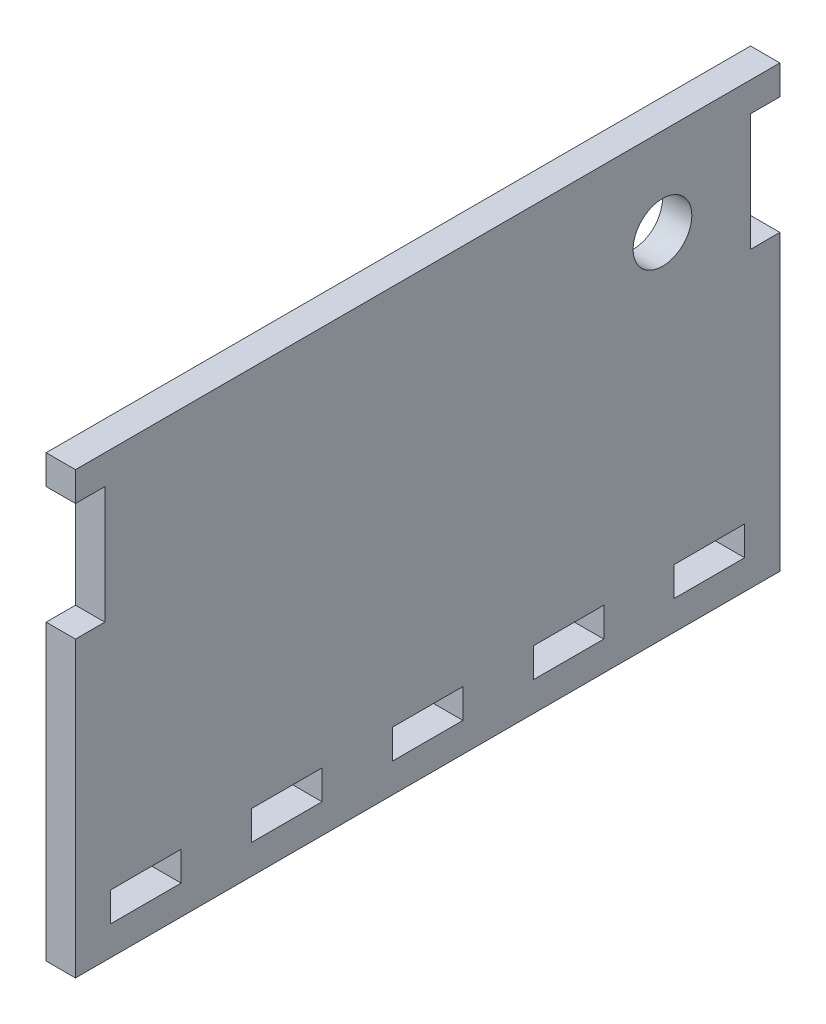
ISO-10303-21;
HEADER;
FILE_DESCRIPTION(('STEP AP214'),'2;1');
FILE_NAME('part.step','',(''),(''),'','','');
FILE_SCHEMA(('AUTOMOTIVE_DESIGN { 1 0 10303 214 1 1 1 1 }'));
ENDSEC;
DATA;
#1=APPLICATION_CONTEXT('core data for automotive mechanical design processes');
#2=APPLICATION_PROTOCOL_DEFINITION('international standard','automotive_design',2000,#1);
#3=PRODUCT_CONTEXT('',#1,'mechanical');
#4=PRODUCT('Part','Part','',(#3));
#5=PRODUCT_RELATED_PRODUCT_CATEGORY('part','',(#4));
#6=PRODUCT_DEFINITION_FORMATION('','',#4);
#7=PRODUCT_DEFINITION_CONTEXT('part definition',#1,'design');
#8=PRODUCT_DEFINITION('design','',#6,#7);
#9=PRODUCT_DEFINITION_SHAPE('','',#8);
#10=(LENGTH_UNIT() NAMED_UNIT(*) SI_UNIT(.MILLI.,.METRE.));
#11=(NAMED_UNIT(*) PLANE_ANGLE_UNIT() SI_UNIT($,.RADIAN.));
#12=(NAMED_UNIT(*) SI_UNIT($,.STERADIAN.) SOLID_ANGLE_UNIT());
#13=UNCERTAINTY_MEASURE_WITH_UNIT(LENGTH_MEASURE(1.E-05),#10,'distance_accuracy_value','');
#14=(GEOMETRIC_REPRESENTATION_CONTEXT(3) GLOBAL_UNCERTAINTY_ASSIGNED_CONTEXT((#13)) GLOBAL_UNIT_ASSIGNED_CONTEXT((#10,
#11,#12)) REPRESENTATION_CONTEXT('',''));
#15=CARTESIAN_POINT('',(0.,0.,0.));
#16=DIRECTION('',(0.,0.,1.));
#17=DIRECTION('',(1.,0.,0.));
#18=AXIS2_PLACEMENT_3D('',#15,#16,#17);
#19=CARTESIAN_POINT('',(1.5875,0.,0.));
#20=DIRECTION('',(-1.,0.,0.));
#21=DIRECTION('',(0.,0.,1.));
#22=AXIS2_PLACEMENT_3D('',#19,#20,#21);
#23=PLANE('',#22);
#24=DIRECTION('',(0.,0.,1.));
#25=VECTOR('',#24,1.);
#26=CARTESIAN_POINT('',(1.5875,-17.4625,-11.43));
#27=LINE('',#26,#25);
#28=CARTESIAN_POINT('',(1.5875,-17.4625,-19.05));
#29=VERTEX_POINT('',#28);
#30=CARTESIAN_POINT('',(1.5875,-17.4625,-11.43));
#31=VERTEX_POINT('',#30);
#32=EDGE_CURVE('E278',#29,#31,#27,.T.);
#33=ORIENTED_EDGE('',*,*,#32,.F.);
#34=DIRECTION('',(0.,1.,0.));
#35=VECTOR('',#34,1.);
#36=CARTESIAN_POINT('',(1.5875,-17.4625,-19.05));
#37=LINE('',#36,#35);
#38=CARTESIAN_POINT('',(1.5875,-20.6375,-19.05));
#39=VERTEX_POINT('',#38);
#40=EDGE_CURVE('E286',#39,#29,#37,.T.);
#41=ORIENTED_EDGE('',*,*,#40,.F.);
#42=DIRECTION('',(0.,0.,-1.));
#43=VECTOR('',#42,1.);
#44=CARTESIAN_POINT('',(1.5875,-20.6375,-11.43));
#45=LINE('',#44,#43);
#46=CARTESIAN_POINT('',(1.5875,-20.6375,-11.43));
#47=VERTEX_POINT('',#46);
#48=EDGE_CURVE('E283',#47,#39,#45,.T.);
#49=ORIENTED_EDGE('',*,*,#48,.F.);
#50=DIRECTION('',(0.,-1.,0.));
#51=VECTOR('',#50,1.);
#52=CARTESIAN_POINT('',(1.5875,-17.4625,-11.43));
#53=LINE('',#52,#51);
#54=EDGE_CURVE('E280',#31,#47,#53,.T.);
#55=ORIENTED_EDGE('',*,*,#54,.F.);
#56=EDGE_LOOP('',(#33,#41,#49,#55));
#57=FACE_BOUND('',#56,.T.);
#58=DIRECTION('',(0.,0.,1.));
#59=VECTOR('',#58,1.);
#60=CARTESIAN_POINT('',(1.5875,-17.4625,19.05));
#61=LINE('',#60,#59);
#62=CARTESIAN_POINT('',(1.5875,-17.4625,11.43));
#63=VERTEX_POINT('',#62);
#64=CARTESIAN_POINT('',(1.5875,-17.4625,19.05));
#65=VERTEX_POINT('',#64);
#66=EDGE_CURVE('E340',#63,#65,#61,.T.);
#67=ORIENTED_EDGE('',*,*,#66,.F.);
#68=DIRECTION('',(0.,1.,0.));
#69=VECTOR('',#68,1.);
#70=CARTESIAN_POINT('',(1.5875,-17.4625,11.43));
#71=LINE('',#70,#69);
#72=CARTESIAN_POINT('',(1.5875,-20.6375,11.43));
#73=VERTEX_POINT('',#72);
#74=EDGE_CURVE('E348',#73,#63,#71,.T.);
#75=ORIENTED_EDGE('',*,*,#74,.F.);
#76=DIRECTION('',(0.,0.,-1.));
#77=VECTOR('',#76,1.);
#78=CARTESIAN_POINT('',(1.5875,-20.6375,19.05));
#79=LINE('',#78,#77);
#80=CARTESIAN_POINT('',(1.5875,-20.6375,19.05));
#81=VERTEX_POINT('',#80);
#82=EDGE_CURVE('E345',#81,#73,#79,.T.);
#83=ORIENTED_EDGE('',*,*,#82,.F.);
#84=DIRECTION('',(0.,-1.,0.));
#85=VECTOR('',#84,1.);
#86=CARTESIAN_POINT('',(1.5875,-17.4625,19.05));
#87=LINE('',#86,#85);
#88=EDGE_CURVE('E342',#65,#81,#87,.T.);
#89=ORIENTED_EDGE('',*,*,#88,.F.);
#90=EDGE_LOOP('',(#67,#75,#83,#89));
#91=FACE_BOUND('',#90,.T.);
#92=DIRECTION('',(0.,1.,0.));
#93=VECTOR('',#92,1.);
#94=CARTESIAN_POINT('',(1.5875,20.6375,-38.1));
#95=LINE('',#94,#93);
#96=CARTESIAN_POINT('',(1.5875,20.6375,-38.1));
#97=VERTEX_POINT('',#96);
#98=CARTESIAN_POINT('',(1.5875,23.8125,-38.1));
#99=VERTEX_POINT('',#98);
#100=EDGE_CURVE('E408',#97,#99,#95,.T.);
#101=ORIENTED_EDGE('',*,*,#100,.T.);
#102=DIRECTION('',(0.,0.,1.));
#103=VECTOR('',#102,1.);
#104=CARTESIAN_POINT('',(1.5875,23.8125,38.1));
#105=LINE('',#104,#103);
#106=CARTESIAN_POINT('',(1.5875,23.8125,38.1));
#107=VERTEX_POINT('',#106);
#108=EDGE_CURVE('E411',#99,#107,#105,.T.);
#109=ORIENTED_EDGE('',*,*,#108,.T.);
#110=DIRECTION('',(0.,-1.,0.));
#111=VECTOR('',#110,1.);
#112=CARTESIAN_POINT('',(1.5875,20.6375,38.1));
#113=LINE('',#112,#111);
#114=CARTESIAN_POINT('',(1.5875,20.6375,38.1));
#115=VERTEX_POINT('',#114);
#116=EDGE_CURVE('E414',#107,#115,#113,.T.);
#117=ORIENTED_EDGE('',*,*,#116,.T.);
#118=DIRECTION('',(0.,0.,-1.));
#119=VECTOR('',#118,1.);
#120=CARTESIAN_POINT('',(1.5875,20.6375,38.1));
#121=LINE('',#120,#119);
#122=CARTESIAN_POINT('',(1.5875,20.6375,34.925));
#123=VERTEX_POINT('',#122);
#124=EDGE_CURVE('E416',#115,#123,#121,.T.);
#125=ORIENTED_EDGE('',*,*,#124,.T.);
#126=DIRECTION('',(0.,-1.,0.));
#127=VECTOR('',#126,1.);
#128=CARTESIAN_POINT('',(1.5875,20.6375,34.925));
#129=LINE('',#128,#127);
#130=CARTESIAN_POINT('',(1.5875,7.9375,34.925));
#131=VERTEX_POINT('',#130);
#132=EDGE_CURVE('E418',#123,#131,#129,.T.);
#133=ORIENTED_EDGE('',*,*,#132,.T.);
#134=DIRECTION('',(0.,0.,1.));
#135=VECTOR('',#134,1.);
#136=CARTESIAN_POINT('',(1.5875,7.9375,38.1));
#137=LINE('',#136,#135);
#138=CARTESIAN_POINT('',(1.5875,7.9375,38.1));
#139=VERTEX_POINT('',#138);
#140=EDGE_CURVE('E420',#131,#139,#137,.T.);
#141=ORIENTED_EDGE('',*,*,#140,.T.);
#142=DIRECTION('',(0.,-1.,0.));
#143=VECTOR('',#142,1.);
#144=CARTESIAN_POINT('',(1.5875,-23.8125,38.1));
#145=LINE('',#144,#143);
#146=CARTESIAN_POINT('',(1.5875,-23.8125,38.1));
#147=VERTEX_POINT('',#146);
#148=EDGE_CURVE('E422',#139,#147,#145,.T.);
#149=ORIENTED_EDGE('',*,*,#148,.T.);
#150=DIRECTION('',(0.,0.,-1.));
#151=VECTOR('',#150,1.);
#152=CARTESIAN_POINT('',(1.5875,-23.8125,38.1));
#153=LINE('',#152,#151);
#154=CARTESIAN_POINT('',(1.5875,-23.8125,-38.1));
#155=VERTEX_POINT('',#154);
#156=EDGE_CURVE('E424',#147,#155,#153,.T.);
#157=ORIENTED_EDGE('',*,*,#156,.T.);
#158=DIRECTION('',(0.,1.,0.));
#159=VECTOR('',#158,1.);
#160=CARTESIAN_POINT('',(1.5875,-23.8125,-38.1));
#161=LINE('',#160,#159);
#162=CARTESIAN_POINT('',(1.5875,7.9375,-38.1));
#163=VERTEX_POINT('',#162);
#164=EDGE_CURVE('E426',#155,#163,#161,.T.);
#165=ORIENTED_EDGE('',*,*,#164,.T.);
#166=DIRECTION('',(0.,0.,1.));
#167=VECTOR('',#166,1.);
#168=CARTESIAN_POINT('',(1.5875,7.9375,-38.1));
#169=LINE('',#168,#167);
#170=CARTESIAN_POINT('',(1.5875,7.9375,-34.925));
#171=VERTEX_POINT('',#170);
#172=EDGE_CURVE('E428',#163,#171,#169,.T.);
#173=ORIENTED_EDGE('',*,*,#172,.T.);
#174=DIRECTION('',(0.,1.,0.));
#175=VECTOR('',#174,1.);
#176=CARTESIAN_POINT('',(1.5875,20.6375,-34.925));
#177=LINE('',#176,#175);
#178=CARTESIAN_POINT('',(1.5875,20.6375,-34.925));
#179=VERTEX_POINT('',#178);
#180=EDGE_CURVE('E430',#171,#179,#177,.T.);
#181=ORIENTED_EDGE('',*,*,#180,.T.);
#182=DIRECTION('',(0.,0.,-1.));
#183=VECTOR('',#182,1.);
#184=CARTESIAN_POINT('',(1.5875,20.6375,-38.1));
#185=LINE('',#184,#183);
#186=EDGE_CURVE('E432',#179,#97,#185,.T.);
#187=ORIENTED_EDGE('',*,*,#186,.T.);
#188=EDGE_LOOP('',(#101,#109,#117,#125,#133,#141,#149,#157,#165,#173,#181,#187));
#189=FACE_BOUND('',#188,.T.);
#190=DIRECTION('',(0.,-1.,0.));
#191=VECTOR('',#190,1.);
#192=CARTESIAN_POINT('',(1.5875,-17.4625,34.29));
#193=LINE('',#192,#191);
#194=CARTESIAN_POINT('',(1.5875,-17.4625,34.29));
#195=VERTEX_POINT('',#194);
#196=CARTESIAN_POINT('',(1.5875,-20.6375,34.29));
#197=VERTEX_POINT('',#196);
#198=EDGE_CURVE('E377',#195,#197,#193,.T.);
#199=ORIENTED_EDGE('',*,*,#198,.F.);
#200=DIRECTION('',(0.,0.,1.));
#201=VECTOR('',#200,1.);
#202=CARTESIAN_POINT('',(1.5875,-17.4625,34.29));
#203=LINE('',#202,#201);
#204=CARTESIAN_POINT('',(1.5875,-17.4625,26.67));
#205=VERTEX_POINT('',#204);
#206=EDGE_CURVE('E385',#205,#195,#203,.T.);
#207=ORIENTED_EDGE('',*,*,#206,.F.);
#208=DIRECTION('',(0.,1.,0.));
#209=VECTOR('',#208,1.);
#210=CARTESIAN_POINT('',(1.5875,-17.4625,26.67));
#211=LINE('',#210,#209);
#212=CARTESIAN_POINT('',(1.5875,-20.6375,26.67));
#213=VERTEX_POINT('',#212);
#214=EDGE_CURVE('E382',#213,#205,#211,.T.);
#215=ORIENTED_EDGE('',*,*,#214,.F.);
#216=DIRECTION('',(0.,0.,-1.));
#217=VECTOR('',#216,1.);
#218=CARTESIAN_POINT('',(1.5875,-20.6375,34.29));
#219=LINE('',#218,#217);
#220=EDGE_CURVE('E379',#197,#213,#219,.T.);
#221=ORIENTED_EDGE('',*,*,#220,.F.);
#222=EDGE_LOOP('',(#199,#207,#215,#221));
#223=FACE_BOUND('',#222,.T.);
#224=CARTESIAN_POINT('',(1.5875,14.2875,-25.4));
#225=DIRECTION('',(1.,0.,0.));
#226=DIRECTION('',(0.,0.,-1.));
#227=AXIS2_PLACEMENT_3D('',#224,#225,#226);
#228=CIRCLE('',#227,3.175);
#229=CARTESIAN_POINT('',(1.5875,14.2875,-28.575));
#230=VERTEX_POINT('',#229);
#231=EDGE_CURVE('E371',#230,#230,#228,.T.);
#232=ORIENTED_EDGE('',*,*,#231,.F.);
#233=EDGE_LOOP('',(#232));
#234=FACE_BOUND('',#233,.T.);
#235=DIRECTION('',(0.,0.,1.));
#236=VECTOR('',#235,1.);
#237=CARTESIAN_POINT('',(1.5875,-17.4625,3.80999999999999));
#238=LINE('',#237,#236);
#239=CARTESIAN_POINT('',(1.5875,-17.4625,-3.81));
#240=VERTEX_POINT('',#239);
#241=CARTESIAN_POINT('',(1.5875,-17.4625,3.80999999999999));
#242=VERTEX_POINT('',#241);
#243=EDGE_CURVE('E309',#240,#242,#238,.T.);
#244=ORIENTED_EDGE('',*,*,#243,.F.);
#245=DIRECTION('',(0.,1.,0.));
#246=VECTOR('',#245,1.);
#247=CARTESIAN_POINT('',(1.5875,-17.4625,-3.81));
#248=LINE('',#247,#246);
#249=CARTESIAN_POINT('',(1.5875,-20.6375,-3.81));
#250=VERTEX_POINT('',#249);
#251=EDGE_CURVE('E317',#250,#240,#248,.T.);
#252=ORIENTED_EDGE('',*,*,#251,.F.);
#253=DIRECTION('',(0.,0.,-1.));
#254=VECTOR('',#253,1.);
#255=CARTESIAN_POINT('',(1.5875,-20.6375,3.81));
#256=LINE('',#255,#254);
#257=CARTESIAN_POINT('',(1.5875,-20.6375,3.81));
#258=VERTEX_POINT('',#257);
#259=EDGE_CURVE('E314',#258,#250,#256,.T.);
#260=ORIENTED_EDGE('',*,*,#259,.F.);
#261=DIRECTION('',(0.,-1.,0.));
#262=VECTOR('',#261,1.);
#263=CARTESIAN_POINT('',(1.5875,-17.4625,3.80999999999999));
#264=LINE('',#263,#262);
#265=EDGE_CURVE('E311',#242,#258,#264,.T.);
#266=ORIENTED_EDGE('',*,*,#265,.F.);
#267=EDGE_LOOP('',(#244,#252,#260,#266));
#268=FACE_BOUND('',#267,.T.);
#269=DIRECTION('',(0.,0.,1.));
#270=VECTOR('',#269,1.);
#271=CARTESIAN_POINT('',(1.5875,-17.4625,-26.67));
#272=LINE('',#271,#270);
#273=CARTESIAN_POINT('',(1.5875,-17.4625,-34.29));
#274=VERTEX_POINT('',#273);
#275=CARTESIAN_POINT('',(1.5875,-17.4625,-26.67));
#276=VERTEX_POINT('',#275);
#277=EDGE_CURVE('E242',#274,#276,#272,.T.);
#278=ORIENTED_EDGE('',*,*,#277,.F.);
#279=DIRECTION('',(0.,1.,0.));
#280=VECTOR('',#279,1.);
#281=CARTESIAN_POINT('',(1.5875,-17.4625,-34.29));
#282=LINE('',#281,#280);
#283=CARTESIAN_POINT('',(1.5875,-20.6375,-34.29));
#284=VERTEX_POINT('',#283);
#285=EDGE_CURVE('E264',#284,#274,#282,.T.);
#286=ORIENTED_EDGE('',*,*,#285,.F.);
#287=DIRECTION('',(0.,0.,-1.));
#288=VECTOR('',#287,1.);
#289=CARTESIAN_POINT('',(1.5875,-20.6375,-26.67));
#290=LINE('',#289,#288);
#291=CARTESIAN_POINT('',(1.5875,-20.6375,-26.67));
#292=VERTEX_POINT('',#291);
#293=EDGE_CURVE('E262',#292,#284,#290,.T.);
#294=ORIENTED_EDGE('',*,*,#293,.F.);
#295=DIRECTION('',(0.,-1.,0.));
#296=VECTOR('',#295,1.);
#297=CARTESIAN_POINT('',(1.5875,-17.4625,-26.67));
#298=LINE('',#297,#296);
#299=EDGE_CURVE('E250',#276,#292,#298,.T.);
#300=ORIENTED_EDGE('',*,*,#299,.F.);
#301=EDGE_LOOP('',(#278,#286,#294,#300));
#302=FACE_BOUND('',#301,.T.);
#303=ADVANCED_FACE('F33',(#57,#91,#189,#223,#234,#268,#302),#23,.F.);
#304=CARTESIAN_POINT('',(-1.5875,0.,0.));
#305=DIRECTION('',(-1.,0.,0.));
#306=DIRECTION('',(0.,0.,1.));
#307=AXIS2_PLACEMENT_3D('',#304,#305,#306);
#308=PLANE('',#307);
#309=DIRECTION('',(0.,0.,1.));
#310=VECTOR('',#309,1.);
#311=CARTESIAN_POINT('',(-1.5875,-17.4625,34.29));
#312=LINE('',#311,#310);
#313=CARTESIAN_POINT('',(-1.5875,-17.4625,26.67));
#314=VERTEX_POINT('',#313);
#315=CARTESIAN_POINT('',(-1.5875,-17.4625,34.29));
#316=VERTEX_POINT('',#315);
#317=EDGE_CURVE('E380',#314,#316,#312,.T.);
#318=ORIENTED_EDGE('',*,*,#317,.T.);
#319=DIRECTION('',(0.,-1.,0.));
#320=VECTOR('',#319,1.);
#321=CARTESIAN_POINT('',(-1.5875,-17.4625,34.29));
#322=LINE('',#321,#320);
#323=CARTESIAN_POINT('',(-1.5875,-20.6375,34.29));
#324=VERTEX_POINT('',#323);
#325=EDGE_CURVE('E374',#316,#324,#322,.T.);
#326=ORIENTED_EDGE('',*,*,#325,.T.);
#327=DIRECTION('',(0.,0.,-1.));
#328=VECTOR('',#327,1.);
#329=CARTESIAN_POINT('',(-1.5875,-20.6375,34.29));
#330=LINE('',#329,#328);
#331=CARTESIAN_POINT('',(-1.5875,-20.6375,26.67));
#332=VERTEX_POINT('',#331);
#333=EDGE_CURVE('E390',#324,#332,#330,.T.);
#334=ORIENTED_EDGE('',*,*,#333,.T.);
#335=DIRECTION('',(0.,1.,0.));
#336=VECTOR('',#335,1.);
#337=CARTESIAN_POINT('',(-1.5875,-17.4625,26.67));
#338=LINE('',#337,#336);
#339=EDGE_CURVE('E393',#332,#314,#338,.T.);
#340=ORIENTED_EDGE('',*,*,#339,.T.);
#341=EDGE_LOOP('',(#318,#326,#334,#340));
#342=FACE_BOUND('',#341,.T.);
#343=DIRECTION('',(0.,1.,0.));
#344=VECTOR('',#343,1.);
#345=CARTESIAN_POINT('',(-1.5875,20.6375,-38.1));
#346=LINE('',#345,#344);
#347=CARTESIAN_POINT('',(-1.5875,20.6375,-38.1));
#348=VERTEX_POINT('',#347);
#349=CARTESIAN_POINT('',(-1.5875,23.8125,-38.1));
#350=VERTEX_POINT('',#349);
#351=EDGE_CURVE('E407',#348,#350,#346,.T.);
#352=ORIENTED_EDGE('',*,*,#351,.F.);
#353=DIRECTION('',(0.,0.,-1.));
#354=VECTOR('',#353,1.);
#355=CARTESIAN_POINT('',(-1.5875,20.6375,-38.1));
#356=LINE('',#355,#354);
#357=CARTESIAN_POINT('',(-1.5875,20.6375,-34.925));
#358=VERTEX_POINT('',#357);
#359=EDGE_CURVE('E412',#358,#348,#356,.T.);
#360=ORIENTED_EDGE('',*,*,#359,.F.);
#361=DIRECTION('',(0.,1.,0.));
#362=VECTOR('',#361,1.);
#363=CARTESIAN_POINT('',(-1.5875,20.6375,-34.925));
#364=LINE('',#363,#362);
#365=CARTESIAN_POINT('',(-1.5875,7.9375,-34.925));
#366=VERTEX_POINT('',#365);
#367=EDGE_CURVE('E455',#366,#358,#364,.T.);
#368=ORIENTED_EDGE('',*,*,#367,.F.);
#369=DIRECTION('',(0.,0.,1.));
#370=VECTOR('',#369,1.);
#371=CARTESIAN_POINT('',(-1.5875,7.9375,-38.1));
#372=LINE('',#371,#370);
#373=CARTESIAN_POINT('',(-1.5875,7.9375,-38.1));
#374=VERTEX_POINT('',#373);
#375=EDGE_CURVE('E453',#374,#366,#372,.T.);
#376=ORIENTED_EDGE('',*,*,#375,.F.);
#377=DIRECTION('',(0.,1.,0.));
#378=VECTOR('',#377,1.);
#379=CARTESIAN_POINT('',(-1.5875,-23.8125,-38.1));
#380=LINE('',#379,#378);
#381=CARTESIAN_POINT('',(-1.5875,-23.8125,-38.1));
#382=VERTEX_POINT('',#381);
#383=EDGE_CURVE('E451',#382,#374,#380,.T.);
#384=ORIENTED_EDGE('',*,*,#383,.F.);
#385=DIRECTION('',(0.,0.,-1.));
#386=VECTOR('',#385,1.);
#387=CARTESIAN_POINT('',(-1.5875,-23.8125,38.1));
#388=LINE('',#387,#386);
#389=CARTESIAN_POINT('',(-1.5875,-23.8125,38.1));
#390=VERTEX_POINT('',#389);
#391=EDGE_CURVE('E449',#390,#382,#388,.T.);
#392=ORIENTED_EDGE('',*,*,#391,.F.);
#393=DIRECTION('',(0.,-1.,0.));
#394=VECTOR('',#393,1.);
#395=CARTESIAN_POINT('',(-1.5875,-23.8125,38.1));
#396=LINE('',#395,#394);
#397=CARTESIAN_POINT('',(-1.5875,7.9375,38.1));
#398=VERTEX_POINT('',#397);
#399=EDGE_CURVE('E447',#398,#390,#396,.T.);
#400=ORIENTED_EDGE('',*,*,#399,.F.);
#401=DIRECTION('',(0.,0.,1.));
#402=VECTOR('',#401,1.);
#403=CARTESIAN_POINT('',(-1.5875,7.9375,38.1));
#404=LINE('',#403,#402);
#405=CARTESIAN_POINT('',(-1.5875,7.9375,34.925));
#406=VERTEX_POINT('',#405);
#407=EDGE_CURVE('E445',#406,#398,#404,.T.);
#408=ORIENTED_EDGE('',*,*,#407,.F.);
#409=DIRECTION('',(0.,-1.,0.));
#410=VECTOR('',#409,1.);
#411=CARTESIAN_POINT('',(-1.5875,20.6375,34.925));
#412=LINE('',#411,#410);
#413=CARTESIAN_POINT('',(-1.5875,20.6375,34.925));
#414=VERTEX_POINT('',#413);
#415=EDGE_CURVE('E443',#414,#406,#412,.T.);
#416=ORIENTED_EDGE('',*,*,#415,.F.);
#417=DIRECTION('',(0.,0.,-1.));
#418=VECTOR('',#417,1.);
#419=CARTESIAN_POINT('',(-1.5875,20.6375,38.1));
#420=LINE('',#419,#418);
#421=CARTESIAN_POINT('',(-1.5875,20.6375,38.1));
#422=VERTEX_POINT('',#421);
#423=EDGE_CURVE('E441',#422,#414,#420,.T.);
#424=ORIENTED_EDGE('',*,*,#423,.F.);
#425=DIRECTION('',(0.,-1.,0.));
#426=VECTOR('',#425,1.);
#427=CARTESIAN_POINT('',(-1.5875,20.6375,38.1));
#428=LINE('',#427,#426);
#429=CARTESIAN_POINT('',(-1.5875,23.8125,38.1));
#430=VERTEX_POINT('',#429);
#431=EDGE_CURVE('E439',#430,#422,#428,.T.);
#432=ORIENTED_EDGE('',*,*,#431,.F.);
#433=DIRECTION('',(0.,0.,1.));
#434=VECTOR('',#433,1.);
#435=CARTESIAN_POINT('',(-1.5875,23.8125,38.1));
#436=LINE('',#435,#434);
#437=EDGE_CURVE('E437',#350,#430,#436,.T.);
#438=ORIENTED_EDGE('',*,*,#437,.F.);
#439=EDGE_LOOP('',(#352,#360,#368,#376,#384,#392,#400,#408,#416,#424,#432,#438));
#440=FACE_BOUND('',#439,.T.);
#441=CARTESIAN_POINT('',(-1.5875,14.2875,-25.4));
#442=DIRECTION('',(1.,0.,0.));
#443=DIRECTION('',(0.,0.,-1.));
#444=AXIS2_PLACEMENT_3D('',#441,#442,#443);
#445=CIRCLE('',#444,3.175);
#446=CARTESIAN_POINT('',(-1.5875,14.2875,-28.575));
#447=VERTEX_POINT('',#446);
#448=EDGE_CURVE('E370',#447,#447,#445,.T.);
#449=ORIENTED_EDGE('',*,*,#448,.T.);
#450=EDGE_LOOP('',(#449));
#451=FACE_BOUND('',#450,.T.);
#452=DIRECTION('',(0.,1.,0.));
#453=VECTOR('',#452,1.);
#454=CARTESIAN_POINT('',(-1.5875,-17.4625,11.43));
#455=LINE('',#454,#453);
#456=CARTESIAN_POINT('',(-1.5875,-20.6375,11.43));
#457=VERTEX_POINT('',#456);
#458=CARTESIAN_POINT('',(-1.5875,-17.4625,11.43));
#459=VERTEX_POINT('',#458);
#460=EDGE_CURVE('E343',#457,#459,#455,.T.);
#461=ORIENTED_EDGE('',*,*,#460,.T.);
#462=DIRECTION('',(0.,0.,1.));
#463=VECTOR('',#462,1.);
#464=CARTESIAN_POINT('',(-1.5875,-17.4625,19.05));
#465=LINE('',#464,#463);
#466=CARTESIAN_POINT('',(-1.5875,-17.4625,19.05));
#467=VERTEX_POINT('',#466);
#468=EDGE_CURVE('E339',#459,#467,#465,.T.);
#469=ORIENTED_EDGE('',*,*,#468,.T.);
#470=DIRECTION('',(0.,-1.,0.));
#471=VECTOR('',#470,1.);
#472=CARTESIAN_POINT('',(-1.5875,-17.4625,19.05));
#473=LINE('',#472,#471);
#474=CARTESIAN_POINT('',(-1.5875,-20.6375,19.05));
#475=VERTEX_POINT('',#474);
#476=EDGE_CURVE('E353',#467,#475,#473,.T.);
#477=ORIENTED_EDGE('',*,*,#476,.T.);
#478=DIRECTION('',(0.,0.,-1.));
#479=VECTOR('',#478,1.);
#480=CARTESIAN_POINT('',(-1.5875,-20.6375,19.05));
#481=LINE('',#480,#479);
#482=EDGE_CURVE('E356',#475,#457,#481,.T.);
#483=ORIENTED_EDGE('',*,*,#482,.T.);
#484=EDGE_LOOP('',(#461,#469,#477,#483));
#485=FACE_BOUND('',#484,.T.);
#486=DIRECTION('',(0.,1.,0.));
#487=VECTOR('',#486,1.);
#488=CARTESIAN_POINT('',(-1.5875,-17.4625,-3.81));
#489=LINE('',#488,#487);
#490=CARTESIAN_POINT('',(-1.5875,-20.6375,-3.81));
#491=VERTEX_POINT('',#490);
#492=CARTESIAN_POINT('',(-1.5875,-17.4625,-3.81));
#493=VERTEX_POINT('',#492);
#494=EDGE_CURVE('E312',#491,#493,#489,.T.);
#495=ORIENTED_EDGE('',*,*,#494,.T.);
#496=DIRECTION('',(0.,0.,1.));
#497=VECTOR('',#496,1.);
#498=CARTESIAN_POINT('',(-1.5875,-17.4625,3.80999999999999));
#499=LINE('',#498,#497);
#500=CARTESIAN_POINT('',(-1.5875,-17.4625,3.80999999999999));
#501=VERTEX_POINT('',#500);
#502=EDGE_CURVE('E308',#493,#501,#499,.T.);
#503=ORIENTED_EDGE('',*,*,#502,.T.);
#504=DIRECTION('',(0.,-1.,0.));
#505=VECTOR('',#504,1.);
#506=CARTESIAN_POINT('',(-1.5875,-17.4625,3.80999999999999));
#507=LINE('',#506,#505);
#508=CARTESIAN_POINT('',(-1.5875,-20.6375,3.81));
#509=VERTEX_POINT('',#508);
#510=EDGE_CURVE('E322',#501,#509,#507,.T.);
#511=ORIENTED_EDGE('',*,*,#510,.T.);
#512=DIRECTION('',(0.,0.,-1.));
#513=VECTOR('',#512,1.);
#514=CARTESIAN_POINT('',(-1.5875,-20.6375,3.81));
#515=LINE('',#514,#513);
#516=EDGE_CURVE('E325',#509,#491,#515,.T.);
#517=ORIENTED_EDGE('',*,*,#516,.T.);
#518=EDGE_LOOP('',(#495,#503,#511,#517));
#519=FACE_BOUND('',#518,.T.);
#520=DIRECTION('',(0.,1.,0.));
#521=VECTOR('',#520,1.);
#522=CARTESIAN_POINT('',(-1.5875,-17.4625,-19.05));
#523=LINE('',#522,#521);
#524=CARTESIAN_POINT('',(-1.5875,-20.6375,-19.05));
#525=VERTEX_POINT('',#524);
#526=CARTESIAN_POINT('',(-1.5875,-17.4625,-19.05));
#527=VERTEX_POINT('',#526);
#528=EDGE_CURVE('E281',#525,#527,#523,.T.);
#529=ORIENTED_EDGE('',*,*,#528,.T.);
#530=DIRECTION('',(0.,0.,1.));
#531=VECTOR('',#530,1.);
#532=CARTESIAN_POINT('',(-1.5875,-17.4625,-11.43));
#533=LINE('',#532,#531);
#534=CARTESIAN_POINT('',(-1.5875,-17.4625,-11.43));
#535=VERTEX_POINT('',#534);
#536=EDGE_CURVE('E258',#527,#535,#533,.T.);
#537=ORIENTED_EDGE('',*,*,#536,.T.);
#538=DIRECTION('',(0.,-1.,0.));
#539=VECTOR('',#538,1.);
#540=CARTESIAN_POINT('',(-1.5875,-17.4625,-11.43));
#541=LINE('',#540,#539);
#542=CARTESIAN_POINT('',(-1.5875,-20.6375,-11.43));
#543=VERTEX_POINT('',#542);
#544=EDGE_CURVE('E291',#535,#543,#541,.T.);
#545=ORIENTED_EDGE('',*,*,#544,.T.);
#546=DIRECTION('',(0.,0.,-1.));
#547=VECTOR('',#546,1.);
#548=CARTESIAN_POINT('',(-1.5875,-20.6375,-11.43));
#549=LINE('',#548,#547);
#550=EDGE_CURVE('E294',#543,#525,#549,.T.);
#551=ORIENTED_EDGE('',*,*,#550,.T.);
#552=EDGE_LOOP('',(#529,#537,#545,#551));
#553=FACE_BOUND('',#552,.T.);
#554=DIRECTION('',(0.,1.,0.));
#555=VECTOR('',#554,1.);
#556=CARTESIAN_POINT('',(-1.5875,-17.4625,-34.29));
#557=LINE('',#556,#555);
#558=CARTESIAN_POINT('',(-1.5875,-20.6375,-34.29));
#559=VERTEX_POINT('',#558);
#560=CARTESIAN_POINT('',(-1.5875,-17.4625,-34.29));
#561=VERTEX_POINT('',#560);
#562=EDGE_CURVE('E251',#559,#561,#557,.T.);
#563=ORIENTED_EDGE('',*,*,#562,.T.);
#564=DIRECTION('',(0.,0.,1.));
#565=VECTOR('',#564,1.);
#566=CARTESIAN_POINT('',(-1.5875,-17.4625,-26.67));
#567=LINE('',#566,#565);
#568=CARTESIAN_POINT('',(-1.5875,-17.4625,-26.67));
#569=VERTEX_POINT('',#568);
#570=EDGE_CURVE('E56',#561,#569,#567,.T.);
#571=ORIENTED_EDGE('',*,*,#570,.T.);
#572=DIRECTION('',(0.,-1.,0.));
#573=VECTOR('',#572,1.);
#574=CARTESIAN_POINT('',(-1.5875,-17.4625,-26.67));
#575=LINE('',#574,#573);
#576=CARTESIAN_POINT('',(-1.5875,-20.6375,-26.67));
#577=VERTEX_POINT('',#576);
#578=EDGE_CURVE('E257',#569,#577,#575,.T.);
#579=ORIENTED_EDGE('',*,*,#578,.T.);
#580=DIRECTION('',(0.,0.,-1.));
#581=VECTOR('',#580,1.);
#582=CARTESIAN_POINT('',(-1.5875,-20.6375,-26.67));
#583=LINE('',#582,#581);
#584=EDGE_CURVE('E270',#577,#559,#583,.T.);
#585=ORIENTED_EDGE('',*,*,#584,.T.);
#586=EDGE_LOOP('',(#563,#571,#579,#585));
#587=FACE_BOUND('',#586,.T.);
#588=ADVANCED_FACE('F497',(#342,#440,#451,#485,#519,#553,#587),#308,.T.);
#589=CARTESIAN_POINT('',(1.5875,20.6375,-38.1));
#590=DIRECTION('',(0.,0.,1.));
#591=DIRECTION('',(1.,0.,0.));
#592=AXIS2_PLACEMENT_3D('',#589,#590,#591);
#593=PLANE('',#592);
#594=ORIENTED_EDGE('',*,*,#351,.T.);
#595=DIRECTION('',(-1.,0.,0.));
#596=VECTOR('',#595,1.);
#597=CARTESIAN_POINT('',(1.5875,23.8125,-38.1));
#598=LINE('',#597,#596);
#599=EDGE_CURVE('E11',#99,#350,#598,.T.);
#600=ORIENTED_EDGE('',*,*,#599,.F.);
#601=ORIENTED_EDGE('',*,*,#100,.F.);
#602=DIRECTION('',(-1.,0.,0.));
#603=VECTOR('',#602,1.);
#604=CARTESIAN_POINT('',(1.5875,20.6375,-38.1));
#605=LINE('',#604,#603);
#606=EDGE_CURVE('E434',#97,#348,#605,.T.);
#607=ORIENTED_EDGE('',*,*,#606,.T.);
#608=EDGE_LOOP('',(#594,#600,#601,#607));
#609=FACE_BOUND('',#608,.T.);
#610=ADVANCED_FACE('F35',(#609),#593,.F.);
#611=CARTESIAN_POINT('',(1.5875,23.8125,38.1));
#612=DIRECTION('',(0.,-1.,0.));
#613=DIRECTION('',(0.,0.,-1.));
#614=AXIS2_PLACEMENT_3D('',#611,#612,#613);
#615=PLANE('',#614);
#616=ORIENTED_EDGE('',*,*,#437,.T.);
#617=DIRECTION('',(-1.,0.,0.));
#618=VECTOR('',#617,1.);
#619=CARTESIAN_POINT('',(1.5875,23.8125,38.1));
#620=LINE('',#619,#618);
#621=EDGE_CURVE('E41',#107,#430,#620,.T.);
#622=ORIENTED_EDGE('',*,*,#621,.F.);
#623=ORIENTED_EDGE('',*,*,#108,.F.);
#624=ORIENTED_EDGE('',*,*,#599,.T.);
#625=EDGE_LOOP('',(#616,#622,#623,#624));
#626=FACE_BOUND('',#625,.T.);
#627=ADVANCED_FACE('F515',(#626),#615,.F.);
#628=CARTESIAN_POINT('',(1.5875,20.6375,38.1));
#629=DIRECTION('',(0.,0.,-1.));
#630=DIRECTION('',(-1.,0.,0.));
#631=AXIS2_PLACEMENT_3D('',#628,#629,#630);
#632=PLANE('',#631);
#633=ORIENTED_EDGE('',*,*,#431,.T.);
#634=DIRECTION('',(-1.,0.,0.));
#635=VECTOR('',#634,1.);
#636=CARTESIAN_POINT('',(1.5875,20.6375,38.1));
#637=LINE('',#636,#635);
#638=EDGE_CURVE('E484',#115,#422,#637,.T.);
#639=ORIENTED_EDGE('',*,*,#638,.F.);
#640=ORIENTED_EDGE('',*,*,#116,.F.);
#641=ORIENTED_EDGE('',*,*,#621,.T.);
#642=EDGE_LOOP('',(#633,#639,#640,#641));
#643=FACE_BOUND('',#642,.T.);
#644=ADVANCED_FACE('F491',(#643),#632,.F.);
#645=CARTESIAN_POINT('',(1.5875,20.6375,38.1));
#646=DIRECTION('',(0.,1.,0.));
#647=DIRECTION('',(0.,0.,1.));
#648=AXIS2_PLACEMENT_3D('',#645,#646,#647);
#649=PLANE('',#648);
#650=ORIENTED_EDGE('',*,*,#423,.T.);
#651=DIRECTION('',(-1.,0.,0.));
#652=VECTOR('',#651,1.);
#653=CARTESIAN_POINT('',(1.5875,20.6375,34.925));
#654=LINE('',#653,#652);
#655=EDGE_CURVE('E481',#123,#414,#654,.T.);
#656=ORIENTED_EDGE('',*,*,#655,.F.);
#657=ORIENTED_EDGE('',*,*,#124,.F.);
#658=ORIENTED_EDGE('',*,*,#638,.T.);
#659=EDGE_LOOP('',(#650,#656,#657,#658));
#660=FACE_BOUND('',#659,.T.);
#661=ADVANCED_FACE('F503',(#660),#649,.F.);
#662=CARTESIAN_POINT('',(1.5875,20.6375,34.925));
#663=DIRECTION('',(0.,0.,-1.));
#664=DIRECTION('',(0.,1.,0.));
#665=AXIS2_PLACEMENT_3D('',#662,#663,#664);
#666=PLANE('',#665);
#667=ORIENTED_EDGE('',*,*,#415,.T.);
#668=DIRECTION('',(-1.,0.,0.));
#669=VECTOR('',#668,1.);
#670=CARTESIAN_POINT('',(1.5875,7.9375,34.925));
#671=LINE('',#670,#669);
#672=EDGE_CURVE('E478',#131,#406,#671,.T.);
#673=ORIENTED_EDGE('',*,*,#672,.F.);
#674=ORIENTED_EDGE('',*,*,#132,.F.);
#675=ORIENTED_EDGE('',*,*,#655,.T.);
#676=EDGE_LOOP('',(#667,#673,#674,#675));
#677=FACE_BOUND('',#676,.T.);
#678=ADVANCED_FACE('F507',(#677),#666,.F.);
#679=CARTESIAN_POINT('',(1.5875,7.9375,38.1));
#680=DIRECTION('',(0.,-1.,0.));
#681=DIRECTION('',(0.,0.,-1.));
#682=AXIS2_PLACEMENT_3D('',#679,#680,#681);
#683=PLANE('',#682);
#684=ORIENTED_EDGE('',*,*,#407,.T.);
#685=DIRECTION('',(-1.,0.,0.));
#686=VECTOR('',#685,1.);
#687=CARTESIAN_POINT('',(1.5875,7.9375,38.1));
#688=LINE('',#687,#686);
#689=EDGE_CURVE('E475',#139,#398,#688,.T.);
#690=ORIENTED_EDGE('',*,*,#689,.F.);
#691=ORIENTED_EDGE('',*,*,#140,.F.);
#692=ORIENTED_EDGE('',*,*,#672,.T.);
#693=EDGE_LOOP('',(#684,#690,#691,#692));
#694=FACE_BOUND('',#693,.T.);
#695=ADVANCED_FACE('F548',(#694),#683,.F.);
#696=CARTESIAN_POINT('',(1.5875,-23.8125,38.1));
#697=DIRECTION('',(0.,0.,-1.));
#698=DIRECTION('',(-1.,0.,0.));
#699=AXIS2_PLACEMENT_3D('',#696,#697,#698);
#700=PLANE('',#699);
#701=ORIENTED_EDGE('',*,*,#399,.T.);
#702=DIRECTION('',(-1.,0.,0.));
#703=VECTOR('',#702,1.);
#704=CARTESIAN_POINT('',(1.5875,-23.8125,38.1));
#705=LINE('',#704,#703);
#706=EDGE_CURVE('E472',#147,#390,#705,.T.);
#707=ORIENTED_EDGE('',*,*,#706,.F.);
#708=ORIENTED_EDGE('',*,*,#148,.F.);
#709=ORIENTED_EDGE('',*,*,#689,.T.);
#710=EDGE_LOOP('',(#701,#707,#708,#709));
#711=FACE_BOUND('',#710,.T.);
#712=ADVANCED_FACE('F546',(#711),#700,.F.);
#713=CARTESIAN_POINT('',(1.5875,-23.8125,38.1));
#714=DIRECTION('',(0.,1.,0.));
#715=DIRECTION('',(0.,0.,1.));
#716=AXIS2_PLACEMENT_3D('',#713,#714,#715);
#717=PLANE('',#716);
#718=ORIENTED_EDGE('',*,*,#391,.T.);
#719=DIRECTION('',(-1.,0.,0.));
#720=VECTOR('',#719,1.);
#721=CARTESIAN_POINT('',(1.5875,-23.8125,-38.1));
#722=LINE('',#721,#720);
#723=EDGE_CURVE('E469',#155,#382,#722,.T.);
#724=ORIENTED_EDGE('',*,*,#723,.F.);
#725=ORIENTED_EDGE('',*,*,#156,.F.);
#726=ORIENTED_EDGE('',*,*,#706,.T.);
#727=EDGE_LOOP('',(#718,#724,#725,#726));
#728=FACE_BOUND('',#727,.T.);
#729=ADVANCED_FACE('F542',(#728),#717,.F.);
#730=CARTESIAN_POINT('',(1.5875,-23.8125,-38.1));
#731=DIRECTION('',(0.,0.,1.));
#732=DIRECTION('',(1.,0.,0.));
#733=AXIS2_PLACEMENT_3D('',#730,#731,#732);
#734=PLANE('',#733);
#735=ORIENTED_EDGE('',*,*,#383,.T.);
#736=DIRECTION('',(-1.,0.,0.));
#737=VECTOR('',#736,1.);
#738=CARTESIAN_POINT('',(1.5875,7.9375,-38.1));
#739=LINE('',#738,#737);
#740=EDGE_CURVE('E466',#163,#374,#739,.T.);
#741=ORIENTED_EDGE('',*,*,#740,.F.);
#742=ORIENTED_EDGE('',*,*,#164,.F.);
#743=ORIENTED_EDGE('',*,*,#723,.T.);
#744=EDGE_LOOP('',(#735,#741,#742,#743));
#745=FACE_BOUND('',#744,.T.);
#746=ADVANCED_FACE('F537',(#745),#734,.F.);
#747=CARTESIAN_POINT('',(1.5875,7.9375,-38.1));
#748=DIRECTION('',(0.,-1.,0.));
#749=DIRECTION('',(0.,0.,-1.));
#750=AXIS2_PLACEMENT_3D('',#747,#748,#749);
#751=PLANE('',#750);
#752=ORIENTED_EDGE('',*,*,#375,.T.);
#753=DIRECTION('',(-1.,0.,0.));
#754=VECTOR('',#753,1.);
#755=CARTESIAN_POINT('',(1.5875,7.9375,-34.925));
#756=LINE('',#755,#754);
#757=EDGE_CURVE('E463',#171,#366,#756,.T.);
#758=ORIENTED_EDGE('',*,*,#757,.F.);
#759=ORIENTED_EDGE('',*,*,#172,.F.);
#760=ORIENTED_EDGE('',*,*,#740,.T.);
#761=EDGE_LOOP('',(#752,#758,#759,#760));
#762=FACE_BOUND('',#761,.T.);
#763=ADVANCED_FACE('F531',(#762),#751,.F.);
#764=CARTESIAN_POINT('',(1.5875,20.6375,-34.925));
#765=DIRECTION('',(0.,0.,1.));
#766=DIRECTION('',(1.,0.,0.));
#767=AXIS2_PLACEMENT_3D('',#764,#765,#766);
#768=PLANE('',#767);
#769=ORIENTED_EDGE('',*,*,#367,.T.);
#770=DIRECTION('',(-1.,0.,0.));
#771=VECTOR('',#770,1.);
#772=CARTESIAN_POINT('',(1.5875,20.6375,-34.925));
#773=LINE('',#772,#771);
#774=EDGE_CURVE('E460',#179,#358,#773,.T.);
#775=ORIENTED_EDGE('',*,*,#774,.F.);
#776=ORIENTED_EDGE('',*,*,#180,.F.);
#777=ORIENTED_EDGE('',*,*,#757,.T.);
#778=EDGE_LOOP('',(#769,#775,#776,#777));
#779=FACE_BOUND('',#778,.T.);
#780=ADVANCED_FACE('F527',(#779),#768,.F.);
#781=CARTESIAN_POINT('',(1.5875,20.6375,-38.1));
#782=DIRECTION('',(0.,1.,0.));
#783=DIRECTION('',(0.,0.,1.));
#784=AXIS2_PLACEMENT_3D('',#781,#782,#783);
#785=PLANE('',#784);
#786=ORIENTED_EDGE('',*,*,#359,.T.);
#787=ORIENTED_EDGE('',*,*,#606,.F.);
#788=ORIENTED_EDGE('',*,*,#186,.F.);
#789=ORIENTED_EDGE('',*,*,#774,.T.);
#790=EDGE_LOOP('',(#786,#787,#788,#789));
#791=FACE_BOUND('',#790,.T.);
#792=ADVANCED_FACE('F522',(#791),#785,.F.);
#793=CARTESIAN_POINT('',(1.5875,-17.4625,34.29));
#794=DIRECTION('',(0.,0.,-1.));
#795=DIRECTION('',(0.,1.,0.));
#796=AXIS2_PLACEMENT_3D('',#793,#794,#795);
#797=PLANE('',#796);
#798=ORIENTED_EDGE('',*,*,#325,.F.);
#799=DIRECTION('',(-1.,0.,0.));
#800=VECTOR('',#799,1.);
#801=CARTESIAN_POINT('',(1.5875,-17.4625,34.29));
#802=LINE('',#801,#800);
#803=EDGE_CURVE('E387',#195,#316,#802,.T.);
#804=ORIENTED_EDGE('',*,*,#803,.F.);
#805=ORIENTED_EDGE('',*,*,#198,.T.);
#806=DIRECTION('',(-1.,0.,0.));
#807=VECTOR('',#806,1.);
#808=CARTESIAN_POINT('',(1.5875,-20.6375,34.29));
#809=LINE('',#808,#807);
#810=EDGE_CURVE('E404',#197,#324,#809,.T.);
#811=ORIENTED_EDGE('',*,*,#810,.T.);
#812=EDGE_LOOP('',(#798,#804,#805,#811));
#813=FACE_BOUND('',#812,.T.);
#814=ADVANCED_FACE('F568',(#813),#797,.T.);
#815=CARTESIAN_POINT('',(1.5875,-20.6375,34.29));
#816=DIRECTION('',(0.,1.,0.));
#817=DIRECTION('',(0.,0.,1.));
#818=AXIS2_PLACEMENT_3D('',#815,#816,#817);
#819=PLANE('',#818);
#820=ORIENTED_EDGE('',*,*,#333,.F.);
#821=ORIENTED_EDGE('',*,*,#810,.F.);
#822=ORIENTED_EDGE('',*,*,#220,.T.);
#823=DIRECTION('',(-1.,0.,0.));
#824=VECTOR('',#823,1.);
#825=CARTESIAN_POINT('',(1.5875,-20.6375,26.67));
#826=LINE('',#825,#824);
#827=EDGE_CURVE('E402',#213,#332,#826,.T.);
#828=ORIENTED_EDGE('',*,*,#827,.T.);
#829=EDGE_LOOP('',(#820,#821,#822,#828));
#830=FACE_BOUND('',#829,.T.);
#831=ADVANCED_FACE('F606',(#830),#819,.T.);
#832=CARTESIAN_POINT('',(1.5875,-17.4625,26.67));
#833=DIRECTION('',(0.,0.,1.));
#834=DIRECTION('',(1.,0.,0.));
#835=AXIS2_PLACEMENT_3D('',#832,#833,#834);
#836=PLANE('',#835);
#837=ORIENTED_EDGE('',*,*,#339,.F.);
#838=ORIENTED_EDGE('',*,*,#827,.F.);
#839=ORIENTED_EDGE('',*,*,#214,.T.);
#840=DIRECTION('',(-1.,0.,0.));
#841=VECTOR('',#840,1.);
#842=CARTESIAN_POINT('',(1.5875,-17.4625,26.67));
#843=LINE('',#842,#841);
#844=EDGE_CURVE('E400',#205,#314,#843,.T.);
#845=ORIENTED_EDGE('',*,*,#844,.T.);
#846=EDGE_LOOP('',(#837,#838,#839,#845));
#847=FACE_BOUND('',#846,.T.);
#848=ADVANCED_FACE('F613',(#847),#836,.T.);
#849=CARTESIAN_POINT('',(1.5875,-17.4625,34.29));
#850=DIRECTION('',(0.,-1.,0.));
#851=DIRECTION('',(0.,0.,-1.));
#852=AXIS2_PLACEMENT_3D('',#849,#850,#851);
#853=PLANE('',#852);
#854=ORIENTED_EDGE('',*,*,#317,.F.);
#855=ORIENTED_EDGE('',*,*,#844,.F.);
#856=ORIENTED_EDGE('',*,*,#206,.T.);
#857=ORIENTED_EDGE('',*,*,#803,.T.);
#858=EDGE_LOOP('',(#854,#855,#856,#857));
#859=FACE_BOUND('',#858,.T.);
#860=ADVANCED_FACE('F620',(#859),#853,.T.);
#861=CARTESIAN_POINT('',(1.5875,14.2875,-25.4));
#862=DIRECTION('',(-1.,0.,0.));
#863=DIRECTION('',(0.,0.,1.));
#864=AXIS2_PLACEMENT_3D('',#861,#862,#863);
#865=CYLINDRICAL_SURFACE('',#864,3.175);
#866=ORIENTED_EDGE('',*,*,#231,.T.);
#867=EDGE_LOOP('',(#866));
#868=FACE_BOUND('',#867,.T.);
#869=ORIENTED_EDGE('',*,*,#448,.F.);
#870=EDGE_LOOP('',(#869));
#871=FACE_BOUND('',#870,.T.);
#872=ADVANCED_FACE('F628',(#868,#871),#865,.F.);
#873=CARTESIAN_POINT('',(1.5875,-17.4625,19.05));
#874=DIRECTION('',(0.,-1.,0.));
#875=DIRECTION('',(0.,0.,-1.));
#876=AXIS2_PLACEMENT_3D('',#873,#874,#875);
#877=PLANE('',#876);
#878=ORIENTED_EDGE('',*,*,#468,.F.);
#879=DIRECTION('',(-1.,0.,0.));
#880=VECTOR('',#879,1.);
#881=CARTESIAN_POINT('',(1.5875,-17.4625,11.43));
#882=LINE('',#881,#880);
#883=EDGE_CURVE('E350',#63,#459,#882,.T.);
#884=ORIENTED_EDGE('',*,*,#883,.F.);
#885=ORIENTED_EDGE('',*,*,#66,.T.);
#886=DIRECTION('',(-1.,0.,0.));
#887=VECTOR('',#886,1.);
#888=CARTESIAN_POINT('',(1.5875,-17.4625,19.05));
#889=LINE('',#888,#887);
#890=EDGE_CURVE('E367',#65,#467,#889,.T.);
#891=ORIENTED_EDGE('',*,*,#890,.T.);
#892=EDGE_LOOP('',(#878,#884,#885,#891));
#893=FACE_BOUND('',#892,.T.);
#894=ADVANCED_FACE('F636',(#893),#877,.T.);
#895=CARTESIAN_POINT('',(1.5875,-17.4625,19.05));
#896=DIRECTION('',(0.,0.,-1.));
#897=DIRECTION('',(0.,1.,0.));
#898=AXIS2_PLACEMENT_3D('',#895,#896,#897);
#899=PLANE('',#898);
#900=ORIENTED_EDGE('',*,*,#476,.F.);
#901=ORIENTED_EDGE('',*,*,#890,.F.);
#902=ORIENTED_EDGE('',*,*,#88,.T.);
#903=DIRECTION('',(-1.,0.,0.));
#904=VECTOR('',#903,1.);
#905=CARTESIAN_POINT('',(1.5875,-20.6375,19.05));
#906=LINE('',#905,#904);
#907=EDGE_CURVE('E365',#81,#475,#906,.T.);
#908=ORIENTED_EDGE('',*,*,#907,.T.);
#909=EDGE_LOOP('',(#900,#901,#902,#908));
#910=FACE_BOUND('',#909,.T.);
#911=ADVANCED_FACE('F644',(#910),#899,.T.);
#912=CARTESIAN_POINT('',(1.5875,-20.6375,19.05));
#913=DIRECTION('',(0.,1.,0.));
#914=DIRECTION('',(0.,0.,1.));
#915=AXIS2_PLACEMENT_3D('',#912,#913,#914);
#916=PLANE('',#915);
#917=ORIENTED_EDGE('',*,*,#482,.F.);
#918=ORIENTED_EDGE('',*,*,#907,.F.);
#919=ORIENTED_EDGE('',*,*,#82,.T.);
#920=DIRECTION('',(-1.,0.,0.));
#921=VECTOR('',#920,1.);
#922=CARTESIAN_POINT('',(1.5875,-20.6375,11.43));
#923=LINE('',#922,#921);
#924=EDGE_CURVE('E363',#73,#457,#923,.T.);
#925=ORIENTED_EDGE('',*,*,#924,.T.);
#926=EDGE_LOOP('',(#917,#918,#919,#925));
#927=FACE_BOUND('',#926,.T.);
#928=ADVANCED_FACE('F652',(#927),#916,.T.);
#929=CARTESIAN_POINT('',(1.5875,-17.4625,11.43));
#930=DIRECTION('',(0.,0.,1.));
#931=DIRECTION('',(1.,0.,0.));
#932=AXIS2_PLACEMENT_3D('',#929,#930,#931);
#933=PLANE('',#932);
#934=ORIENTED_EDGE('',*,*,#460,.F.);
#935=ORIENTED_EDGE('',*,*,#924,.F.);
#936=ORIENTED_EDGE('',*,*,#74,.T.);
#937=ORIENTED_EDGE('',*,*,#883,.T.);
#938=EDGE_LOOP('',(#934,#935,#936,#937));
#939=FACE_BOUND('',#938,.T.);
#940=ADVANCED_FACE('F660',(#939),#933,.T.);
#941=CARTESIAN_POINT('',(1.5875,-17.4625,3.80999999999999));
#942=DIRECTION('',(0.,-1.,0.));
#943=DIRECTION('',(0.,0.,-1.));
#944=AXIS2_PLACEMENT_3D('',#941,#942,#943);
#945=PLANE('',#944);
#946=ORIENTED_EDGE('',*,*,#502,.F.);
#947=DIRECTION('',(-1.,0.,0.));
#948=VECTOR('',#947,1.);
#949=CARTESIAN_POINT('',(1.5875,-17.4625,-3.81));
#950=LINE('',#949,#948);
#951=EDGE_CURVE('E319',#240,#493,#950,.T.);
#952=ORIENTED_EDGE('',*,*,#951,.F.);
#953=ORIENTED_EDGE('',*,*,#243,.T.);
#954=DIRECTION('',(-1.,0.,0.));
#955=VECTOR('',#954,1.);
#956=CARTESIAN_POINT('',(1.5875,-17.4625,3.80999999999999));
#957=LINE('',#956,#955);
#958=EDGE_CURVE('E336',#242,#501,#957,.T.);
#959=ORIENTED_EDGE('',*,*,#958,.T.);
#960=EDGE_LOOP('',(#946,#952,#953,#959));
#961=FACE_BOUND('',#960,.T.);
#962=ADVANCED_FACE('F668',(#961),#945,.T.);
#963=CARTESIAN_POINT('',(1.5875,-17.4625,3.80999999999999));
#964=DIRECTION('',(0.,0.,-1.));
#965=DIRECTION('',(0.,1.,0.));
#966=AXIS2_PLACEMENT_3D('',#963,#964,#965);
#967=PLANE('',#966);
#968=ORIENTED_EDGE('',*,*,#510,.F.);
#969=ORIENTED_EDGE('',*,*,#958,.F.);
#970=ORIENTED_EDGE('',*,*,#265,.T.);
#971=DIRECTION('',(-1.,0.,0.));
#972=VECTOR('',#971,1.);
#973=CARTESIAN_POINT('',(1.5875,-20.6375,3.81));
#974=LINE('',#973,#972);
#975=EDGE_CURVE('E334',#258,#509,#974,.T.);
#976=ORIENTED_EDGE('',*,*,#975,.T.);
#977=EDGE_LOOP('',(#968,#969,#970,#976));
#978=FACE_BOUND('',#977,.T.);
#979=ADVANCED_FACE('F676',(#978),#967,.T.);
#980=CARTESIAN_POINT('',(1.5875,-20.6375,3.81));
#981=DIRECTION('',(0.,1.,0.));
#982=DIRECTION('',(0.,0.,1.));
#983=AXIS2_PLACEMENT_3D('',#980,#981,#982);
#984=PLANE('',#983);
#985=ORIENTED_EDGE('',*,*,#516,.F.);
#986=ORIENTED_EDGE('',*,*,#975,.F.);
#987=ORIENTED_EDGE('',*,*,#259,.T.);
#988=DIRECTION('',(-1.,0.,0.));
#989=VECTOR('',#988,1.);
#990=CARTESIAN_POINT('',(1.5875,-20.6375,-3.81));
#991=LINE('',#990,#989);
#992=EDGE_CURVE('E332',#250,#491,#991,.T.);
#993=ORIENTED_EDGE('',*,*,#992,.T.);
#994=EDGE_LOOP('',(#985,#986,#987,#993));
#995=FACE_BOUND('',#994,.T.);
#996=ADVANCED_FACE('F684',(#995),#984,.T.);
#997=CARTESIAN_POINT('',(1.5875,-17.4625,-3.81));
#998=DIRECTION('',(0.,0.,1.));
#999=DIRECTION('',(1.,0.,0.));
#1000=AXIS2_PLACEMENT_3D('',#997,#998,#999);
#1001=PLANE('',#1000);
#1002=ORIENTED_EDGE('',*,*,#494,.F.);
#1003=ORIENTED_EDGE('',*,*,#992,.F.);
#1004=ORIENTED_EDGE('',*,*,#251,.T.);
#1005=ORIENTED_EDGE('',*,*,#951,.T.);
#1006=EDGE_LOOP('',(#1002,#1003,#1004,#1005));
#1007=FACE_BOUND('',#1006,.T.);
#1008=ADVANCED_FACE('F692',(#1007),#1001,.T.);
#1009=CARTESIAN_POINT('',(1.5875,-17.4625,-11.43));
#1010=DIRECTION('',(0.,-1.,0.));
#1011=DIRECTION('',(0.,0.,-1.));
#1012=AXIS2_PLACEMENT_3D('',#1009,#1010,#1011);
#1013=PLANE('',#1012);
#1014=ORIENTED_EDGE('',*,*,#536,.F.);
#1015=DIRECTION('',(-1.,0.,0.));
#1016=VECTOR('',#1015,1.);
#1017=CARTESIAN_POINT('',(1.5875,-17.4625,-19.05));
#1018=LINE('',#1017,#1016);
#1019=EDGE_CURVE('E288',#29,#527,#1018,.T.);
#1020=ORIENTED_EDGE('',*,*,#1019,.F.);
#1021=ORIENTED_EDGE('',*,*,#32,.T.);
#1022=DIRECTION('',(-1.,0.,0.));
#1023=VECTOR('',#1022,1.);
#1024=CARTESIAN_POINT('',(1.5875,-17.4625,-11.43));
#1025=LINE('',#1024,#1023);
#1026=EDGE_CURVE('E305',#31,#535,#1025,.T.);
#1027=ORIENTED_EDGE('',*,*,#1026,.T.);
#1028=EDGE_LOOP('',(#1014,#1020,#1021,#1027));
#1029=FACE_BOUND('',#1028,.T.);
#1030=ADVANCED_FACE('F700',(#1029),#1013,.T.);
#1031=CARTESIAN_POINT('',(1.5875,-17.4625,-11.43));
#1032=DIRECTION('',(0.,0.,-1.));
#1033=DIRECTION('',(0.,1.,0.));
#1034=AXIS2_PLACEMENT_3D('',#1031,#1032,#1033);
#1035=PLANE('',#1034);
#1036=ORIENTED_EDGE('',*,*,#544,.F.);
#1037=ORIENTED_EDGE('',*,*,#1026,.F.);
#1038=ORIENTED_EDGE('',*,*,#54,.T.);
#1039=DIRECTION('',(-1.,0.,0.));
#1040=VECTOR('',#1039,1.);
#1041=CARTESIAN_POINT('',(1.5875,-20.6375,-11.43));
#1042=LINE('',#1041,#1040);
#1043=EDGE_CURVE('E303',#47,#543,#1042,.T.);
#1044=ORIENTED_EDGE('',*,*,#1043,.T.);
#1045=EDGE_LOOP('',(#1036,#1037,#1038,#1044));
#1046=FACE_BOUND('',#1045,.T.);
#1047=ADVANCED_FACE('F708',(#1046),#1035,.T.);
#1048=CARTESIAN_POINT('',(1.5875,-20.6375,-11.43));
#1049=DIRECTION('',(0.,1.,0.));
#1050=DIRECTION('',(0.,0.,1.));
#1051=AXIS2_PLACEMENT_3D('',#1048,#1049,#1050);
#1052=PLANE('',#1051);
#1053=ORIENTED_EDGE('',*,*,#550,.F.);
#1054=ORIENTED_EDGE('',*,*,#1043,.F.);
#1055=ORIENTED_EDGE('',*,*,#48,.T.);
#1056=DIRECTION('',(-1.,0.,0.));
#1057=VECTOR('',#1056,1.);
#1058=CARTESIAN_POINT('',(1.5875,-20.6375,-19.05));
#1059=LINE('',#1058,#1057);
#1060=EDGE_CURVE('E301',#39,#525,#1059,.T.);
#1061=ORIENTED_EDGE('',*,*,#1060,.T.);
#1062=EDGE_LOOP('',(#1053,#1054,#1055,#1061));
#1063=FACE_BOUND('',#1062,.T.);
#1064=ADVANCED_FACE('F716',(#1063),#1052,.T.);
#1065=CARTESIAN_POINT('',(1.5875,-17.4625,-19.05));
#1066=DIRECTION('',(0.,0.,1.));
#1067=DIRECTION('',(1.,0.,0.));
#1068=AXIS2_PLACEMENT_3D('',#1065,#1066,#1067);
#1069=PLANE('',#1068);
#1070=ORIENTED_EDGE('',*,*,#528,.F.);
#1071=ORIENTED_EDGE('',*,*,#1060,.F.);
#1072=ORIENTED_EDGE('',*,*,#40,.T.);
#1073=ORIENTED_EDGE('',*,*,#1019,.T.);
#1074=EDGE_LOOP('',(#1070,#1071,#1072,#1073));
#1075=FACE_BOUND('',#1074,.T.);
#1076=ADVANCED_FACE('F724',(#1075),#1069,.T.);
#1077=CARTESIAN_POINT('',(1.5875,-17.4625,-26.67));
#1078=DIRECTION('',(0.,-1.,0.));
#1079=DIRECTION('',(0.,0.,-1.));
#1080=AXIS2_PLACEMENT_3D('',#1077,#1078,#1079);
#1081=PLANE('',#1080);
#1082=ORIENTED_EDGE('',*,*,#570,.F.);
#1083=DIRECTION('',(-1.,0.,0.));
#1084=VECTOR('',#1083,1.);
#1085=CARTESIAN_POINT('',(1.5875,-17.4625,-34.29));
#1086=LINE('',#1085,#1084);
#1087=EDGE_CURVE('E246',#274,#561,#1086,.T.);
#1088=ORIENTED_EDGE('',*,*,#1087,.F.);
#1089=ORIENTED_EDGE('',*,*,#277,.T.);
#1090=DIRECTION('',(-1.,0.,0.));
#1091=VECTOR('',#1090,1.);
#1092=CARTESIAN_POINT('',(1.5875,-17.4625,-26.67));
#1093=LINE('',#1092,#1091);
#1094=EDGE_CURVE('E245',#276,#569,#1093,.T.);
#1095=ORIENTED_EDGE('',*,*,#1094,.T.);
#1096=EDGE_LOOP('',(#1082,#1088,#1089,#1095));
#1097=FACE_BOUND('',#1096,.T.);
#1098=ADVANCED_FACE('F244',(#1097),#1081,.T.);
#1099=CARTESIAN_POINT('',(1.5875,-17.4625,-26.67));
#1100=DIRECTION('',(0.,0.,-1.));
#1101=DIRECTION('',(0.,1.,0.));
#1102=AXIS2_PLACEMENT_3D('',#1099,#1100,#1101);
#1103=PLANE('',#1102);
#1104=ORIENTED_EDGE('',*,*,#578,.F.);
#1105=ORIENTED_EDGE('',*,*,#1094,.F.);
#1106=ORIENTED_EDGE('',*,*,#299,.T.);
#1107=DIRECTION('',(-1.,0.,0.));
#1108=VECTOR('',#1107,1.);
#1109=CARTESIAN_POINT('',(1.5875,-20.6375,-26.67));
#1110=LINE('',#1109,#1108);
#1111=EDGE_CURVE('E259',#292,#577,#1110,.T.);
#1112=ORIENTED_EDGE('',*,*,#1111,.T.);
#1113=EDGE_LOOP('',(#1104,#1105,#1106,#1112));
#1114=FACE_BOUND('',#1113,.T.);
#1115=ADVANCED_FACE('F254',(#1114),#1103,.T.);
#1116=CARTESIAN_POINT('',(1.5875,-20.6375,-26.67));
#1117=DIRECTION('',(0.,1.,0.));
#1118=DIRECTION('',(0.,0.,1.));
#1119=AXIS2_PLACEMENT_3D('',#1116,#1117,#1118);
#1120=PLANE('',#1119);
#1121=ORIENTED_EDGE('',*,*,#584,.F.);
#1122=ORIENTED_EDGE('',*,*,#1111,.F.);
#1123=ORIENTED_EDGE('',*,*,#293,.T.);
#1124=DIRECTION('',(-1.,0.,0.));
#1125=VECTOR('',#1124,1.);
#1126=CARTESIAN_POINT('',(1.5875,-20.6375,-34.29));
#1127=LINE('',#1126,#1125);
#1128=EDGE_CURVE('E48',#284,#559,#1127,.T.);
#1129=ORIENTED_EDGE('',*,*,#1128,.T.);
#1130=EDGE_LOOP('',(#1121,#1122,#1123,#1129));
#1131=FACE_BOUND('',#1130,.T.);
#1132=ADVANCED_FACE('F745',(#1131),#1120,.T.);
#1133=CARTESIAN_POINT('',(1.5875,-17.4625,-34.29));
#1134=DIRECTION('',(0.,0.,1.));
#1135=DIRECTION('',(1.,0.,0.));
#1136=AXIS2_PLACEMENT_3D('',#1133,#1134,#1135);
#1137=PLANE('',#1136);
#1138=ORIENTED_EDGE('',*,*,#562,.F.);
#1139=ORIENTED_EDGE('',*,*,#1128,.F.);
#1140=ORIENTED_EDGE('',*,*,#285,.T.);
#1141=ORIENTED_EDGE('',*,*,#1087,.T.);
#1142=EDGE_LOOP('',(#1138,#1139,#1140,#1141));
#1143=FACE_BOUND('',#1142,.T.);
#1144=ADVANCED_FACE('F752',(#1143),#1137,.T.);
#1145=CLOSED_SHELL('',(#303,#588,#610,#627,#644,#661,#678,#695,#712,#729,#746,#763,#780,#792,
#814,#831,#848,#860,#872,#894,#911,#928,#940,#962,#979,#996,#1008,#1030,#1047,#1064,#1076,#1098,
#1115,#1132,#1144));
#1146=MANIFOLD_SOLID_BREP('B2',#1145);
#1147=ADVANCED_BREP_SHAPE_REPRESENTATION('',(#18,#1146),#14);
#1148=SHAPE_DEFINITION_REPRESENTATION(#9,#1147);
ENDSEC;
END-ISO-10303-21;
